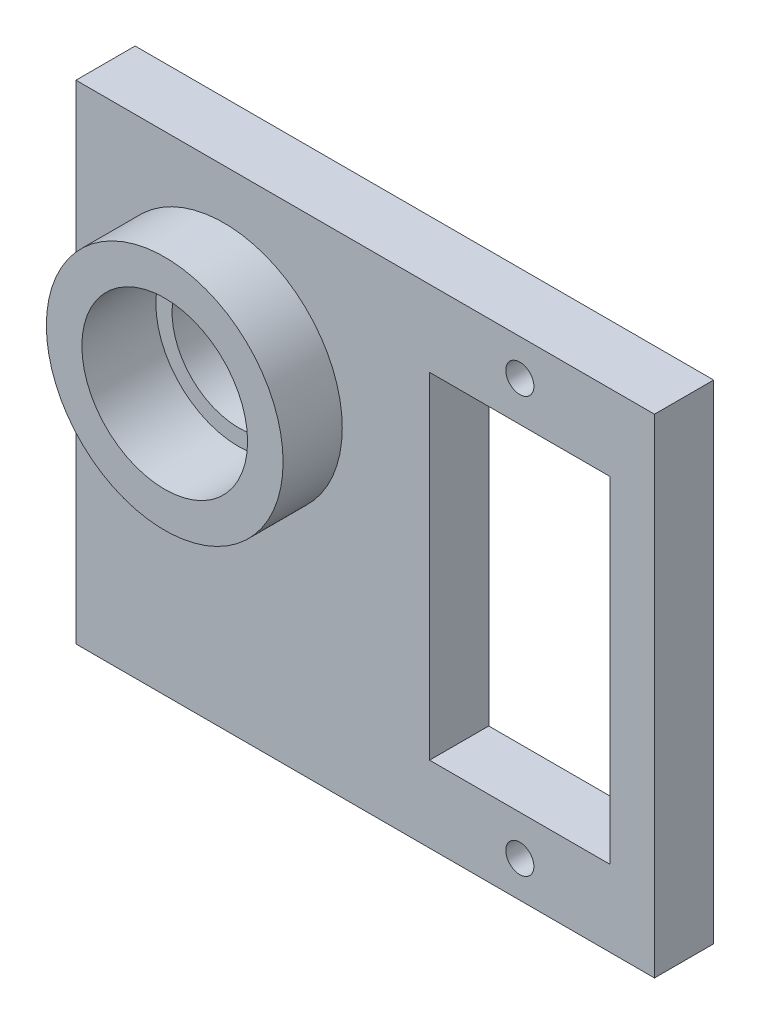
ISO-10303-21;
HEADER;
FILE_DESCRIPTION(('STEP AP214'),'2;1');
FILE_NAME('part.step','',(''),(''),'','','');
FILE_SCHEMA(('AUTOMOTIVE_DESIGN { 1 0 10303 214 1 1 1 1 }'));
ENDSEC;
DATA;
#1=APPLICATION_CONTEXT('core data for automotive mechanical design processes');
#2=APPLICATION_PROTOCOL_DEFINITION('international standard','automotive_design',2000,#1);
#3=PRODUCT_CONTEXT('',#1,'mechanical');
#4=PRODUCT('Part','Part','',(#3));
#5=PRODUCT_RELATED_PRODUCT_CATEGORY('part','',(#4));
#6=PRODUCT_DEFINITION_FORMATION('','',#4);
#7=PRODUCT_DEFINITION_CONTEXT('part definition',#1,'design');
#8=PRODUCT_DEFINITION('design','',#6,#7);
#9=PRODUCT_DEFINITION_SHAPE('','',#8);
#10=(LENGTH_UNIT() NAMED_UNIT(*) SI_UNIT(.MILLI.,.METRE.));
#11=(NAMED_UNIT(*) PLANE_ANGLE_UNIT() SI_UNIT($,.RADIAN.));
#12=(NAMED_UNIT(*) SI_UNIT($,.STERADIAN.) SOLID_ANGLE_UNIT());
#13=UNCERTAINTY_MEASURE_WITH_UNIT(LENGTH_MEASURE(1.E-05),#10,'distance_accuracy_value','');
#14=(GEOMETRIC_REPRESENTATION_CONTEXT(3) GLOBAL_UNCERTAINTY_ASSIGNED_CONTEXT((#13)) GLOBAL_UNIT_ASSIGNED_CONTEXT((#10,
#11,#12)) REPRESENTATION_CONTEXT('',''));
#15=CARTESIAN_POINT('',(0.,0.,0.));
#16=DIRECTION('',(0.,0.,1.));
#17=DIRECTION('',(1.,0.,0.));
#18=AXIS2_PLACEMENT_3D('',#15,#16,#17);
#19=CARTESIAN_POINT('',(-20.,0.,4.));
#20=DIRECTION('',(0.,0.,-1.));
#21=DIRECTION('',(-1.,0.,0.));
#22=AXIS2_PLACEMENT_3D('',#19,#20,#21);
#23=CYLINDRICAL_SURFACE('',#22,4.5);
#24=CARTESIAN_POINT('',(-20.,0.,0.));
#25=DIRECTION('',(0.,0.,1.));
#26=DIRECTION('',(1.,0.,0.));
#27=AXIS2_PLACEMENT_3D('',#24,#25,#26);
#28=CIRCLE('',#27,4.5);
#29=CARTESIAN_POINT('',(-15.5,0.,0.));
#30=VERTEX_POINT('',#29);
#31=EDGE_CURVE('E146',#30,#30,#28,.T.);
#32=ORIENTED_EDGE('',*,*,#31,.F.);
#33=EDGE_LOOP('',(#32));
#34=FACE_BOUND('',#33,.T.);
#35=CARTESIAN_POINT('',(-20.,0.,3.));
#36=DIRECTION('',(0.,0.,1.));
#37=DIRECTION('',(1.,0.,0.));
#38=AXIS2_PLACEMENT_3D('',#35,#36,#37);
#39=CIRCLE('',#38,4.5);
#40=CARTESIAN_POINT('',(-15.5,0.,3.));
#41=VERTEX_POINT('',#40);
#42=EDGE_CURVE('E47',#41,#41,#39,.T.);
#43=ORIENTED_EDGE('',*,*,#42,.T.);
#44=EDGE_LOOP('',(#43));
#45=FACE_BOUND('',#44,.T.);
#46=ADVANCED_FACE('F43',(#34,#45),#23,.F.);
#47=CARTESIAN_POINT('',(0.,0.,4.));
#48=DIRECTION('',(0.,0.,1.));
#49=DIRECTION('',(1.,0.,0.));
#50=AXIS2_PLACEMENT_3D('',#47,#48,#49);
#51=PLANE('',#50);
#52=CARTESIAN_POINT('',(-20.,0.,4.));
#53=DIRECTION('',(0.,0.,1.));
#54=DIRECTION('',(1.,0.,0.));
#55=AXIS2_PLACEMENT_3D('',#52,#53,#54);
#56=CIRCLE('',#55,8.);
#57=CARTESIAN_POINT('',(-12.,0.,4.));
#58=VERTEX_POINT('',#57);
#59=EDGE_CURVE('E434',#58,#58,#56,.T.);
#60=ORIENTED_EDGE('',*,*,#59,.F.);
#61=EDGE_LOOP('',(#60));
#62=FACE_BOUND('',#61,.T.);
#63=DIRECTION('',(-1.,0.,0.));
#64=VECTOR('',#63,1.);
#65=CARTESIAN_POINT('',(-6.1,6.2,4.));
#66=LINE('',#65,#64);
#67=CARTESIAN_POINT('',(6.1,6.2,4.));
#68=VERTEX_POINT('',#67);
#69=CARTESIAN_POINT('',(-6.1,6.2,4.));
#70=VERTEX_POINT('',#69);
#71=EDGE_CURVE('E119',#68,#70,#66,.T.);
#72=ORIENTED_EDGE('',*,*,#71,.F.);
#73=DIRECTION('',(0.,1.,0.));
#74=VECTOR('',#73,1.);
#75=CARTESIAN_POINT('',(6.1,-16.5,4.));
#76=LINE('',#75,#74);
#77=CARTESIAN_POINT('',(6.1,-16.5,4.));
#78=VERTEX_POINT('',#77);
#79=EDGE_CURVE('E110',#78,#68,#76,.T.);
#80=ORIENTED_EDGE('',*,*,#79,.F.);
#81=DIRECTION('',(1.,0.,0.));
#82=VECTOR('',#81,1.);
#83=CARTESIAN_POINT('',(-6.1,-16.5,4.));
#84=LINE('',#83,#82);
#85=CARTESIAN_POINT('',(-6.1,-16.5,4.));
#86=VERTEX_POINT('',#85);
#87=EDGE_CURVE('E138',#86,#78,#84,.T.);
#88=ORIENTED_EDGE('',*,*,#87,.F.);
#89=DIRECTION('',(0.,-1.,0.));
#90=VECTOR('',#89,1.);
#91=CARTESIAN_POINT('',(-6.1,6.2,4.));
#92=LINE('',#91,#90);
#93=EDGE_CURVE('E134',#70,#86,#92,.T.);
#94=ORIENTED_EDGE('',*,*,#93,.F.);
#95=EDGE_LOOP('',(#72,#80,#88,#94));
#96=FACE_BOUND('',#95,.T.);
#97=CARTESIAN_POINT('',(0.,-19.2,4.));
#98=DIRECTION('',(0.,0.,1.));
#99=DIRECTION('',(1.,0.,0.));
#100=AXIS2_PLACEMENT_3D('',#97,#98,#99);
#101=CIRCLE('',#100,0.95);
#102=CARTESIAN_POINT('',(0.95,-19.2,4.));
#103=VERTEX_POINT('',#102);
#104=EDGE_CURVE('E162',#103,#103,#101,.T.);
#105=ORIENTED_EDGE('',*,*,#104,.F.);
#106=EDGE_LOOP('',(#105));
#107=FACE_BOUND('',#106,.T.);
#108=DIRECTION('',(-1.,0.,0.));
#109=VECTOR('',#108,1.);
#110=CARTESIAN_POINT('',(9.1,11.35,4.));
#111=LINE('',#110,#109);
#112=CARTESIAN_POINT('',(9.1,11.35,4.));
#113=VERTEX_POINT('',#112);
#114=CARTESIAN_POINT('',(-30.,11.35,4.));
#115=VERTEX_POINT('',#114);
#116=EDGE_CURVE('E178',#113,#115,#111,.T.);
#117=ORIENTED_EDGE('',*,*,#116,.T.);
#118=DIRECTION('',(0.,-1.,0.));
#119=VECTOR('',#118,1.);
#120=CARTESIAN_POINT('',(-30.,11.35,4.));
#121=LINE('',#120,#119);
#122=CARTESIAN_POINT('',(-30.,-21.65,4.));
#123=VERTEX_POINT('',#122);
#124=EDGE_CURVE('E182',#115,#123,#121,.T.);
#125=ORIENTED_EDGE('',*,*,#124,.T.);
#126=DIRECTION('',(1.,0.,0.));
#127=VECTOR('',#126,1.);
#128=CARTESIAN_POINT('',(-30.,-21.65,4.));
#129=LINE('',#128,#127);
#130=CARTESIAN_POINT('',(9.1,-21.65,4.));
#131=VERTEX_POINT('',#130);
#132=EDGE_CURVE('E186',#123,#131,#129,.T.);
#133=ORIENTED_EDGE('',*,*,#132,.T.);
#134=DIRECTION('',(0.,1.,0.));
#135=VECTOR('',#134,1.);
#136=CARTESIAN_POINT('',(9.1,-21.65,4.));
#137=LINE('',#136,#135);
#138=EDGE_CURVE('E189',#131,#113,#137,.T.);
#139=ORIENTED_EDGE('',*,*,#138,.T.);
#140=EDGE_LOOP('',(#117,#125,#133,#139));
#141=FACE_BOUND('',#140,.T.);
#142=CARTESIAN_POINT('',(0.,8.9,4.));
#143=DIRECTION('',(0.,0.,1.));
#144=DIRECTION('',(1.,0.,0.));
#145=AXIS2_PLACEMENT_3D('',#142,#143,#144);
#146=CIRCLE('',#145,0.95);
#147=CARTESIAN_POINT('',(0.95,8.9,4.));
#148=VERTEX_POINT('',#147);
#149=EDGE_CURVE('E170',#148,#148,#146,.T.);
#150=ORIENTED_EDGE('',*,*,#149,.F.);
#151=EDGE_LOOP('',(#150));
#152=FACE_BOUND('',#151,.T.);
#153=ADVANCED_FACE('F132',(#62,#96,#107,#141,#152),#51,.T.);
#154=CARTESIAN_POINT('',(0.,0.,0.));
#155=DIRECTION('',(0.,0.,1.));
#156=DIRECTION('',(1.,0.,0.));
#157=AXIS2_PLACEMENT_3D('',#154,#155,#156);
#158=PLANE('',#157);
#159=CARTESIAN_POINT('',(0.,-19.2,0.));
#160=DIRECTION('',(0.,0.,1.));
#161=DIRECTION('',(1.,0.,0.));
#162=AXIS2_PLACEMENT_3D('',#159,#160,#161);
#163=CIRCLE('',#162,0.95);
#164=CARTESIAN_POINT('',(0.95,-19.2,0.));
#165=VERTEX_POINT('',#164);
#166=EDGE_CURVE('E128',#165,#165,#163,.T.);
#167=ORIENTED_EDGE('',*,*,#166,.T.);
#168=EDGE_LOOP('',(#167));
#169=FACE_BOUND('',#168,.T.);
#170=CARTESIAN_POINT('',(0.,8.9,0.));
#171=DIRECTION('',(0.,0.,1.));
#172=DIRECTION('',(1.,0.,0.));
#173=AXIS2_PLACEMENT_3D('',#170,#171,#172);
#174=CIRCLE('',#173,0.95);
#175=CARTESIAN_POINT('',(0.95,8.9,0.));
#176=VERTEX_POINT('',#175);
#177=EDGE_CURVE('E166',#176,#176,#174,.T.);
#178=ORIENTED_EDGE('',*,*,#177,.T.);
#179=EDGE_LOOP('',(#178));
#180=FACE_BOUND('',#179,.T.);
#181=DIRECTION('',(-1.,0.,0.));
#182=VECTOR('',#181,1.);
#183=CARTESIAN_POINT('',(9.1,11.35,0.));
#184=LINE('',#183,#182);
#185=CARTESIAN_POINT('',(9.1,11.35,0.));
#186=VERTEX_POINT('',#185);
#187=CARTESIAN_POINT('',(-30.,11.35,0.));
#188=VERTEX_POINT('',#187);
#189=EDGE_CURVE('E174',#186,#188,#184,.T.);
#190=ORIENTED_EDGE('',*,*,#189,.F.);
#191=DIRECTION('',(0.,1.,0.));
#192=VECTOR('',#191,1.);
#193=CARTESIAN_POINT('',(9.1,-21.65,0.));
#194=LINE('',#193,#192);
#195=CARTESIAN_POINT('',(9.1,-21.65,0.));
#196=VERTEX_POINT('',#195);
#197=EDGE_CURVE('E183',#196,#186,#194,.T.);
#198=ORIENTED_EDGE('',*,*,#197,.F.);
#199=DIRECTION('',(1.,0.,0.));
#200=VECTOR('',#199,1.);
#201=CARTESIAN_POINT('',(-30.,-21.65,0.));
#202=LINE('',#201,#200);
#203=CARTESIAN_POINT('',(-30.,-21.65,0.));
#204=VERTEX_POINT('',#203);
#205=EDGE_CURVE('E199',#204,#196,#202,.T.);
#206=ORIENTED_EDGE('',*,*,#205,.F.);
#207=DIRECTION('',(0.,-1.,0.));
#208=VECTOR('',#207,1.);
#209=CARTESIAN_POINT('',(-30.,11.35,0.));
#210=LINE('',#209,#208);
#211=EDGE_CURVE('E196',#188,#204,#210,.T.);
#212=ORIENTED_EDGE('',*,*,#211,.F.);
#213=EDGE_LOOP('',(#190,#198,#206,#212));
#214=FACE_BOUND('',#213,.T.);
#215=DIRECTION('',(0.,1.,0.));
#216=VECTOR('',#215,1.);
#217=CARTESIAN_POINT('',(6.1,-16.5,0.));
#218=LINE('',#217,#216);
#219=CARTESIAN_POINT('',(6.1,-16.5,0.));
#220=VERTEX_POINT('',#219);
#221=CARTESIAN_POINT('',(6.1,6.2,0.));
#222=VERTEX_POINT('',#221);
#223=EDGE_CURVE('E68',#220,#222,#218,.T.);
#224=ORIENTED_EDGE('',*,*,#223,.T.);
#225=DIRECTION('',(-1.,0.,0.));
#226=VECTOR('',#225,1.);
#227=CARTESIAN_POINT('',(-6.1,6.2,0.));
#228=LINE('',#227,#226);
#229=CARTESIAN_POINT('',(-6.1,6.2,0.));
#230=VERTEX_POINT('',#229);
#231=EDGE_CURVE('E126',#222,#230,#228,.T.);
#232=ORIENTED_EDGE('',*,*,#231,.T.);
#233=DIRECTION('',(0.,-1.,0.));
#234=VECTOR('',#233,1.);
#235=CARTESIAN_POINT('',(-6.1,6.2,0.));
#236=LINE('',#235,#234);
#237=CARTESIAN_POINT('',(-6.1,-16.5,0.));
#238=VERTEX_POINT('',#237);
#239=EDGE_CURVE('E149',#230,#238,#236,.T.);
#240=ORIENTED_EDGE('',*,*,#239,.T.);
#241=DIRECTION('',(1.,0.,0.));
#242=VECTOR('',#241,1.);
#243=CARTESIAN_POINT('',(-6.1,-16.5,0.));
#244=LINE('',#243,#242);
#245=EDGE_CURVE('E120',#238,#220,#244,.T.);
#246=ORIENTED_EDGE('',*,*,#245,.T.);
#247=EDGE_LOOP('',(#224,#232,#240,#246));
#248=FACE_BOUND('',#247,.T.);
#249=ORIENTED_EDGE('',*,*,#31,.T.);
#250=EDGE_LOOP('',(#249));
#251=FACE_BOUND('',#250,.T.);
#252=ADVANCED_FACE('F223',(#169,#180,#214,#248,#251),#158,.F.);
#253=CARTESIAN_POINT('',(9.1,11.35,4.));
#254=DIRECTION('',(0.,-1.,0.));
#255=DIRECTION('',(0.,0.,-1.));
#256=AXIS2_PLACEMENT_3D('',#253,#254,#255);
#257=PLANE('',#256);
#258=ORIENTED_EDGE('',*,*,#189,.T.);
#259=DIRECTION('',(0.,0.,-1.));
#260=VECTOR('',#259,1.);
#261=CARTESIAN_POINT('',(-30.,11.35,4.));
#262=LINE('',#261,#260);
#263=EDGE_CURVE('E11',#115,#188,#262,.T.);
#264=ORIENTED_EDGE('',*,*,#263,.F.);
#265=ORIENTED_EDGE('',*,*,#116,.F.);
#266=DIRECTION('',(0.,0.,-1.));
#267=VECTOR('',#266,1.);
#268=CARTESIAN_POINT('',(9.1,11.35,4.));
#269=LINE('',#268,#267);
#270=EDGE_CURVE('E192',#113,#186,#269,.T.);
#271=ORIENTED_EDGE('',*,*,#270,.T.);
#272=EDGE_LOOP('',(#258,#264,#265,#271));
#273=FACE_BOUND('',#272,.T.);
#274=ADVANCED_FACE('F45',(#273),#257,.F.);
#275=CARTESIAN_POINT('',(-30.,11.35,4.));
#276=DIRECTION('',(1.,0.,0.));
#277=DIRECTION('',(0.,0.,-1.));
#278=AXIS2_PLACEMENT_3D('',#275,#276,#277);
#279=PLANE('',#278);
#280=ORIENTED_EDGE('',*,*,#211,.T.);
#281=DIRECTION('',(0.,0.,-1.));
#282=VECTOR('',#281,1.);
#283=CARTESIAN_POINT('',(-30.,-21.65,4.));
#284=LINE('',#283,#282);
#285=EDGE_CURVE('E53',#123,#204,#284,.T.);
#286=ORIENTED_EDGE('',*,*,#285,.F.);
#287=ORIENTED_EDGE('',*,*,#124,.F.);
#288=ORIENTED_EDGE('',*,*,#263,.T.);
#289=EDGE_LOOP('',(#280,#286,#287,#288));
#290=FACE_BOUND('',#289,.T.);
#291=ADVANCED_FACE('F234',(#290),#279,.F.);
#292=CARTESIAN_POINT('',(-30.,-21.65,4.));
#293=DIRECTION('',(0.,1.,0.));
#294=DIRECTION('',(0.,0.,1.));
#295=AXIS2_PLACEMENT_3D('',#292,#293,#294);
#296=PLANE('',#295);
#297=ORIENTED_EDGE('',*,*,#205,.T.);
#298=DIRECTION('',(0.,0.,-1.));
#299=VECTOR('',#298,1.);
#300=CARTESIAN_POINT('',(9.1,-21.65,4.));
#301=LINE('',#300,#299);
#302=EDGE_CURVE('E207',#131,#196,#301,.T.);
#303=ORIENTED_EDGE('',*,*,#302,.F.);
#304=ORIENTED_EDGE('',*,*,#132,.F.);
#305=ORIENTED_EDGE('',*,*,#285,.T.);
#306=EDGE_LOOP('',(#297,#303,#304,#305));
#307=FACE_BOUND('',#306,.T.);
#308=ADVANCED_FACE('F217',(#307),#296,.F.);
#309=CARTESIAN_POINT('',(9.1,-21.65,4.));
#310=DIRECTION('',(-1.,0.,0.));
#311=DIRECTION('',(0.,0.,1.));
#312=AXIS2_PLACEMENT_3D('',#309,#310,#311);
#313=PLANE('',#312);
#314=ORIENTED_EDGE('',*,*,#197,.T.);
#315=ORIENTED_EDGE('',*,*,#270,.F.);
#316=ORIENTED_EDGE('',*,*,#138,.F.);
#317=ORIENTED_EDGE('',*,*,#302,.T.);
#318=EDGE_LOOP('',(#314,#315,#316,#317));
#319=FACE_BOUND('',#318,.T.);
#320=ADVANCED_FACE('F227',(#319),#313,.F.);
#321=CARTESIAN_POINT('',(0.,8.9,4.));
#322=DIRECTION('',(0.,0.,-1.));
#323=DIRECTION('',(-1.,0.,0.));
#324=AXIS2_PLACEMENT_3D('',#321,#322,#323);
#325=CYLINDRICAL_SURFACE('',#324,0.95);
#326=ORIENTED_EDGE('',*,*,#149,.T.);
#327=EDGE_LOOP('',(#326));
#328=FACE_BOUND('',#327,.T.);
#329=ORIENTED_EDGE('',*,*,#177,.F.);
#330=EDGE_LOOP('',(#329));
#331=FACE_BOUND('',#330,.T.);
#332=ADVANCED_FACE('F270',(#328,#331),#325,.F.);
#333=CARTESIAN_POINT('',(0.,-19.2,4.));
#334=DIRECTION('',(0.,0.,-1.));
#335=DIRECTION('',(-1.,0.,0.));
#336=AXIS2_PLACEMENT_3D('',#333,#334,#335);
#337=CYLINDRICAL_SURFACE('',#336,0.95);
#338=ORIENTED_EDGE('',*,*,#104,.T.);
#339=EDGE_LOOP('',(#338));
#340=FACE_BOUND('',#339,.T.);
#341=ORIENTED_EDGE('',*,*,#166,.F.);
#342=EDGE_LOOP('',(#341));
#343=FACE_BOUND('',#342,.T.);
#344=ADVANCED_FACE('F267',(#340,#343),#337,.F.);
#345=CARTESIAN_POINT('',(6.1,-16.5,4.));
#346=DIRECTION('',(-1.,0.,0.));
#347=DIRECTION('',(0.,0.,1.));
#348=AXIS2_PLACEMENT_3D('',#345,#346,#347);
#349=PLANE('',#348);
#350=ORIENTED_EDGE('',*,*,#223,.F.);
#351=DIRECTION('',(0.,0.,-1.));
#352=VECTOR('',#351,1.);
#353=CARTESIAN_POINT('',(6.1,-16.5,4.));
#354=LINE('',#353,#352);
#355=EDGE_CURVE('E114',#78,#220,#354,.T.);
#356=ORIENTED_EDGE('',*,*,#355,.F.);
#357=ORIENTED_EDGE('',*,*,#79,.T.);
#358=DIRECTION('',(0.,0.,-1.));
#359=VECTOR('',#358,1.);
#360=CARTESIAN_POINT('',(6.1,6.2,4.));
#361=LINE('',#360,#359);
#362=EDGE_CURVE('E113',#68,#222,#361,.T.);
#363=ORIENTED_EDGE('',*,*,#362,.T.);
#364=EDGE_LOOP('',(#350,#356,#357,#363));
#365=FACE_BOUND('',#364,.T.);
#366=ADVANCED_FACE('F112',(#365),#349,.T.);
#367=CARTESIAN_POINT('',(-6.1,6.2,4.));
#368=DIRECTION('',(0.,-1.,0.));
#369=DIRECTION('',(1.,0.,0.));
#370=AXIS2_PLACEMENT_3D('',#367,#368,#369);
#371=PLANE('',#370);
#372=ORIENTED_EDGE('',*,*,#231,.F.);
#373=ORIENTED_EDGE('',*,*,#362,.F.);
#374=ORIENTED_EDGE('',*,*,#71,.T.);
#375=DIRECTION('',(0.,0.,-1.));
#376=VECTOR('',#375,1.);
#377=CARTESIAN_POINT('',(-6.1,6.2,4.));
#378=LINE('',#377,#376);
#379=EDGE_CURVE('E129',#70,#230,#378,.T.);
#380=ORIENTED_EDGE('',*,*,#379,.T.);
#381=EDGE_LOOP('',(#372,#373,#374,#380));
#382=FACE_BOUND('',#381,.T.);
#383=ADVANCED_FACE('F123',(#382),#371,.T.);
#384=CARTESIAN_POINT('',(-6.1,6.2,4.));
#385=DIRECTION('',(1.,0.,0.));
#386=DIRECTION('',(0.,0.,-1.));
#387=AXIS2_PLACEMENT_3D('',#384,#385,#386);
#388=PLANE('',#387);
#389=ORIENTED_EDGE('',*,*,#239,.F.);
#390=ORIENTED_EDGE('',*,*,#379,.F.);
#391=ORIENTED_EDGE('',*,*,#93,.T.);
#392=DIRECTION('',(0.,0.,-1.));
#393=VECTOR('',#392,1.);
#394=CARTESIAN_POINT('',(-6.1,-16.5,4.));
#395=LINE('',#394,#393);
#396=EDGE_CURVE('E60',#86,#238,#395,.T.);
#397=ORIENTED_EDGE('',*,*,#396,.T.);
#398=EDGE_LOOP('',(#389,#390,#391,#397));
#399=FACE_BOUND('',#398,.T.);
#400=ADVANCED_FACE('F259',(#399),#388,.T.);
#401=CARTESIAN_POINT('',(-6.1,-16.5,4.));
#402=DIRECTION('',(0.,1.,0.));
#403=DIRECTION('',(0.,0.,1.));
#404=AXIS2_PLACEMENT_3D('',#401,#402,#403);
#405=PLANE('',#404);
#406=ORIENTED_EDGE('',*,*,#245,.F.);
#407=ORIENTED_EDGE('',*,*,#396,.F.);
#408=ORIENTED_EDGE('',*,*,#87,.T.);
#409=ORIENTED_EDGE('',*,*,#355,.T.);
#410=EDGE_LOOP('',(#406,#407,#408,#409));
#411=FACE_BOUND('',#410,.T.);
#412=ADVANCED_FACE('F255',(#411),#405,.T.);
#413=CARTESIAN_POINT('',(-20.,0.,8.));
#414=DIRECTION('',(0.,0.,1.));
#415=DIRECTION('',(1.,0.,0.));
#416=AXIS2_PLACEMENT_3D('',#413,#414,#415);
#417=PLANE('',#416);
#418=CARTESIAN_POINT('',(-20.,0.,8.));
#419=DIRECTION('',(0.,0.,1.));
#420=DIRECTION('',(1.,0.,0.));
#421=AXIS2_PLACEMENT_3D('',#418,#419,#420);
#422=CIRCLE('',#421,5.6);
#423=CARTESIAN_POINT('',(-14.4,0.,8.));
#424=VERTEX_POINT('',#423);
#425=EDGE_CURVE('E430',#424,#424,#422,.T.);
#426=ORIENTED_EDGE('',*,*,#425,.F.);
#427=EDGE_LOOP('',(#426));
#428=FACE_BOUND('',#427,.T.);
#429=CARTESIAN_POINT('',(-20.,0.,8.));
#430=DIRECTION('',(0.,0.,1.));
#431=DIRECTION('',(1.,0.,0.));
#432=AXIS2_PLACEMENT_3D('',#429,#430,#431);
#433=CIRCLE('',#432,8.);
#434=CARTESIAN_POINT('',(-12.,0.,8.));
#435=VERTEX_POINT('',#434);
#436=EDGE_CURVE('E438',#435,#435,#433,.T.);
#437=ORIENTED_EDGE('',*,*,#436,.T.);
#438=EDGE_LOOP('',(#437));
#439=FACE_BOUND('',#438,.T.);
#440=ADVANCED_FACE('F258',(#428,#439),#417,.T.);
#441=CARTESIAN_POINT('',(-20.,0.,8.));
#442=DIRECTION('',(0.,0.,-1.));
#443=DIRECTION('',(-1.,0.,0.));
#444=AXIS2_PLACEMENT_3D('',#441,#442,#443);
#445=CYLINDRICAL_SURFACE('',#444,8.);
#446=ORIENTED_EDGE('',*,*,#436,.F.);
#447=EDGE_LOOP('',(#446));
#448=FACE_BOUND('',#447,.T.);
#449=ORIENTED_EDGE('',*,*,#59,.T.);
#450=EDGE_LOOP('',(#449));
#451=FACE_BOUND('',#450,.T.);
#452=ADVANCED_FACE('F253',(#448,#451),#445,.T.);
#453=CARTESIAN_POINT('',(-20.,0.,3.));
#454=DIRECTION('',(0.,0.,1.));
#455=DIRECTION('',(1.,0.,0.));
#456=AXIS2_PLACEMENT_3D('',#453,#454,#455);
#457=CYLINDRICAL_SURFACE('',#456,5.6);
#458=CARTESIAN_POINT('',(-20.,0.,3.));
#459=DIRECTION('',(0.,0.,1.));
#460=DIRECTION('',(1.,0.,0.));
#461=AXIS2_PLACEMENT_3D('',#458,#459,#460);
#462=CIRCLE('',#461,5.6);
#463=CARTESIAN_POINT('',(-14.4,0.,3.));
#464=VERTEX_POINT('',#463);
#465=EDGE_CURVE('E428',#464,#464,#462,.T.);
#466=ORIENTED_EDGE('',*,*,#465,.F.);
#467=EDGE_LOOP('',(#466));
#468=FACE_BOUND('',#467,.T.);
#469=ORIENTED_EDGE('',*,*,#425,.T.);
#470=EDGE_LOOP('',(#469));
#471=FACE_BOUND('',#470,.T.);
#472=ADVANCED_FACE('F321',(#468,#471),#457,.F.);
#473=CARTESIAN_POINT('',(-20.,0.,3.));
#474=DIRECTION('',(0.,0.,1.));
#475=DIRECTION('',(1.,0.,0.));
#476=AXIS2_PLACEMENT_3D('',#473,#474,#475);
#477=PLANE('',#476);
#478=ORIENTED_EDGE('',*,*,#42,.F.);
#479=EDGE_LOOP('',(#478));
#480=FACE_BOUND('',#479,.T.);
#481=ORIENTED_EDGE('',*,*,#465,.T.);
#482=EDGE_LOOP('',(#481));
#483=FACE_BOUND('',#482,.T.);
#484=ADVANCED_FACE('F327',(#480,#483),#477,.T.);
#485=CLOSED_SHELL('',(#46,#153,#252,#274,#291,#308,#320,#332,#344,#366,#383,#400,#412,#440,#452,
#472,#484));
#486=MANIFOLD_SOLID_BREP('B2',#485);
#487=ADVANCED_BREP_SHAPE_REPRESENTATION('',(#18,#486),#14);
#488=SHAPE_DEFINITION_REPRESENTATION(#9,#487);
ENDSEC;
END-ISO-10303-21;
